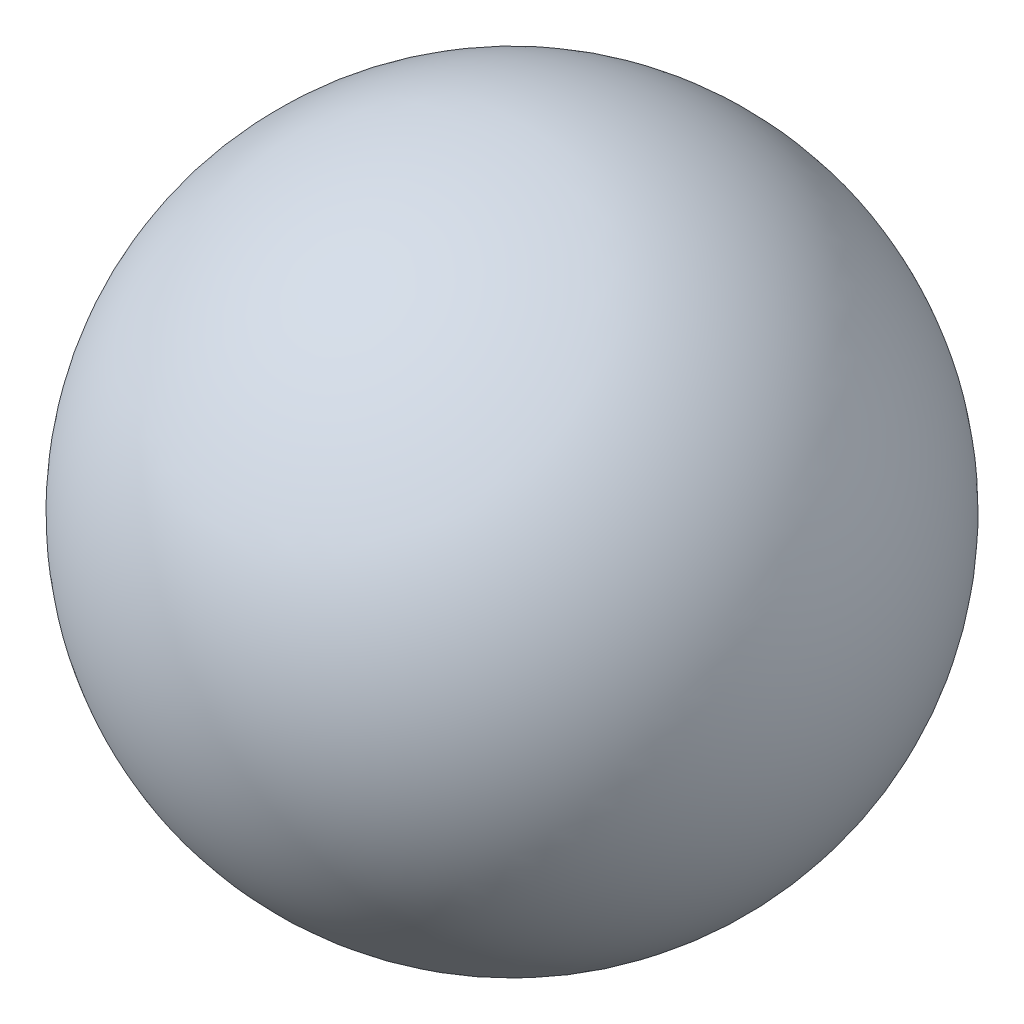
ISO-10303-21;
HEADER;
FILE_DESCRIPTION(('STEP AP214'),'2;1');
FILE_NAME('part.step','',(''),(''),'','','');
FILE_SCHEMA(('AUTOMOTIVE_DESIGN { 1 0 10303 214 1 1 1 1 }'));
ENDSEC;
DATA;
#1=APPLICATION_CONTEXT('core data for automotive mechanical design processes');
#2=APPLICATION_PROTOCOL_DEFINITION('international standard','automotive_design',2000,#1);
#3=PRODUCT_CONTEXT('',#1,'mechanical');
#4=PRODUCT('Part','Part','',(#3));
#5=PRODUCT_RELATED_PRODUCT_CATEGORY('part','',(#4));
#6=PRODUCT_DEFINITION_FORMATION('','',#4);
#7=PRODUCT_DEFINITION_CONTEXT('part definition',#1,'design');
#8=PRODUCT_DEFINITION('design','',#6,#7);
#9=PRODUCT_DEFINITION_SHAPE('','',#8);
#10=(LENGTH_UNIT() NAMED_UNIT(*) SI_UNIT(.MILLI.,.METRE.));
#11=(NAMED_UNIT(*) PLANE_ANGLE_UNIT() SI_UNIT($,.RADIAN.));
#12=(NAMED_UNIT(*) SI_UNIT($,.STERADIAN.) SOLID_ANGLE_UNIT());
#13=UNCERTAINTY_MEASURE_WITH_UNIT(LENGTH_MEASURE(1.E-05),#10,'distance_accuracy_value','');
#14=(GEOMETRIC_REPRESENTATION_CONTEXT(3) GLOBAL_UNCERTAINTY_ASSIGNED_CONTEXT((#13)) GLOBAL_UNIT_ASSIGNED_CONTEXT((#10,
#11,#12)) REPRESENTATION_CONTEXT('',''));
#15=CARTESIAN_POINT('',(0.,0.,0.));
#16=DIRECTION('',(0.,0.,1.));
#17=DIRECTION('',(1.,0.,0.));
#18=AXIS2_PLACEMENT_3D('',#15,#16,#17);
#19=CARTESIAN_POINT('',(9.57126743659143,-2.,6.8156686874616));
#20=DIRECTION('',(0.,0.,1.));
#21=DIRECTION('',(1.,0.,0.));
#22=AXIS2_PLACEMENT_3D('',#19,#20,#21);
#23=SPHERICAL_SURFACE('',#22,1.05);
#24=CARTESIAN_POINT('',(9.57126743659143,-2.,7.8656686874616));
#25=VERTEX_POINT('',#24);
#26=VERTEX_LOOP('',#25);
#27=FACE_BOUND('',#26,.T.);
#28=ADVANCED_FACE('F13',(#27),#23,.T.);
#29=CLOSED_SHELL('',(#28));
#30=MANIFOLD_SOLID_BREP('B1',#29);
#31=ADVANCED_BREP_SHAPE_REPRESENTATION('',(#18,#30),#14);
#32=SHAPE_DEFINITION_REPRESENTATION(#9,#31);
ENDSEC;
END-ISO-10303-21;
